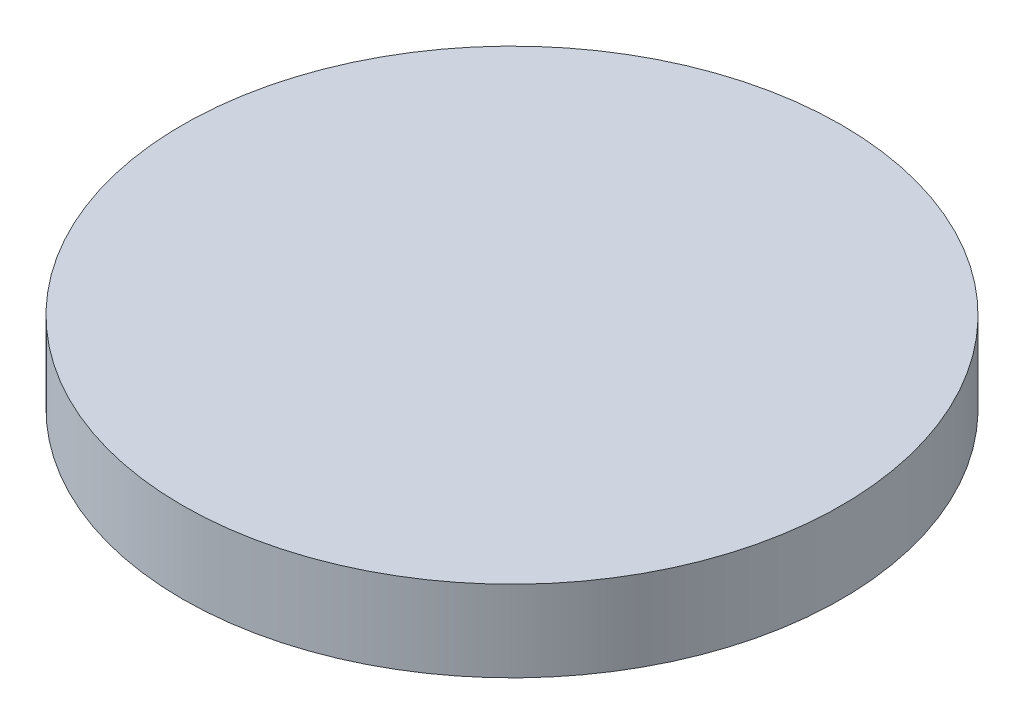
ISO-10303-21;
HEADER;
FILE_DESCRIPTION(('STEP AP214'),'2;1');
FILE_NAME('part.step','',(''),(''),'','','');
FILE_SCHEMA(('AUTOMOTIVE_DESIGN { 1 0 10303 214 1 1 1 1 }'));
ENDSEC;
DATA;
#1=APPLICATION_CONTEXT('core data for automotive mechanical design processes');
#2=APPLICATION_PROTOCOL_DEFINITION('international standard','automotive_design',2000,#1);
#3=PRODUCT_CONTEXT('',#1,'mechanical');
#4=PRODUCT('Part','Part','',(#3));
#5=PRODUCT_RELATED_PRODUCT_CATEGORY('part','',(#4));
#6=PRODUCT_DEFINITION_FORMATION('','',#4);
#7=PRODUCT_DEFINITION_CONTEXT('part definition',#1,'design');
#8=PRODUCT_DEFINITION('design','',#6,#7);
#9=PRODUCT_DEFINITION_SHAPE('','',#8);
#10=(LENGTH_UNIT() NAMED_UNIT(*) SI_UNIT(.MILLI.,.METRE.));
#11=(NAMED_UNIT(*) PLANE_ANGLE_UNIT() SI_UNIT($,.RADIAN.));
#12=(NAMED_UNIT(*) SI_UNIT($,.STERADIAN.) SOLID_ANGLE_UNIT());
#13=UNCERTAINTY_MEASURE_WITH_UNIT(LENGTH_MEASURE(1.E-05),#10,'distance_accuracy_value','');
#14=(GEOMETRIC_REPRESENTATION_CONTEXT(3) GLOBAL_UNCERTAINTY_ASSIGNED_CONTEXT((#13)) GLOBAL_UNIT_ASSIGNED_CONTEXT((#10,
#11,#12)) REPRESENTATION_CONTEXT('',''));
#15=CARTESIAN_POINT('',(0.,0.,0.));
#16=DIRECTION('',(0.,0.,1.));
#17=DIRECTION('',(1.,0.,0.));
#18=AXIS2_PLACEMENT_3D('',#15,#16,#17);
#19=CARTESIAN_POINT('',(0.,25.,0.));
#20=DIRECTION('',(0.,-1.,0.));
#21=DIRECTION('',(0.,0.,-1.));
#22=AXIS2_PLACEMENT_3D('',#19,#20,#21);
#23=CYLINDRICAL_SURFACE('',#22,101.6);
#24=CARTESIAN_POINT('',(0.,25.,0.));
#25=DIRECTION('',(0.,1.,0.));
#26=DIRECTION('',(0.,0.,1.));
#27=AXIS2_PLACEMENT_3D('',#24,#25,#26);
#28=CIRCLE('',#27,101.6);
#29=CARTESIAN_POINT('',(0.,25.,101.6));
#30=VERTEX_POINT('',#29);
#31=EDGE_CURVE('E10',#30,#30,#28,.T.);
#32=ORIENTED_EDGE('',*,*,#31,.F.);
#33=EDGE_LOOP('',(#32));
#34=FACE_BOUND('',#33,.T.);
#35=CARTESIAN_POINT('',(0.,0.,0.));
#36=DIRECTION('',(0.,1.,0.));
#37=DIRECTION('',(0.,0.,1.));
#38=AXIS2_PLACEMENT_3D('',#35,#36,#37);
#39=CIRCLE('',#38,101.6);
#40=CARTESIAN_POINT('',(0.,0.,101.6));
#41=VERTEX_POINT('',#40);
#42=EDGE_CURVE('E34',#41,#41,#39,.T.);
#43=ORIENTED_EDGE('',*,*,#42,.T.);
#44=EDGE_LOOP('',(#43));
#45=FACE_BOUND('',#44,.T.);
#46=ADVANCED_FACE('F31',(#34,#45),#23,.T.);
#47=CARTESIAN_POINT('',(0.,25.,0.));
#48=DIRECTION('',(0.,1.,0.));
#49=DIRECTION('',(0.,0.,1.));
#50=AXIS2_PLACEMENT_3D('',#47,#48,#49);
#51=PLANE('',#50);
#52=ORIENTED_EDGE('',*,*,#31,.T.);
#53=EDGE_LOOP('',(#52));
#54=FACE_BOUND('',#53,.T.);
#55=ADVANCED_FACE('F46',(#54),#51,.T.);
#56=CARTESIAN_POINT('',(0.,0.,0.));
#57=DIRECTION('',(0.,1.,0.));
#58=DIRECTION('',(0.,0.,1.));
#59=AXIS2_PLACEMENT_3D('',#56,#57,#58);
#60=PLANE('',#59);
#61=ORIENTED_EDGE('',*,*,#42,.F.);
#62=EDGE_LOOP('',(#61));
#63=FACE_BOUND('',#62,.T.);
#64=ADVANCED_FACE('F44',(#63),#60,.F.);
#65=CLOSED_SHELL('',(#46,#55,#64));
#66=MANIFOLD_SOLID_BREP('B2',#65);
#67=ADVANCED_BREP_SHAPE_REPRESENTATION('',(#18,#66),#14);
#68=SHAPE_DEFINITION_REPRESENTATION(#9,#67);
ENDSEC;
END-ISO-10303-21;
